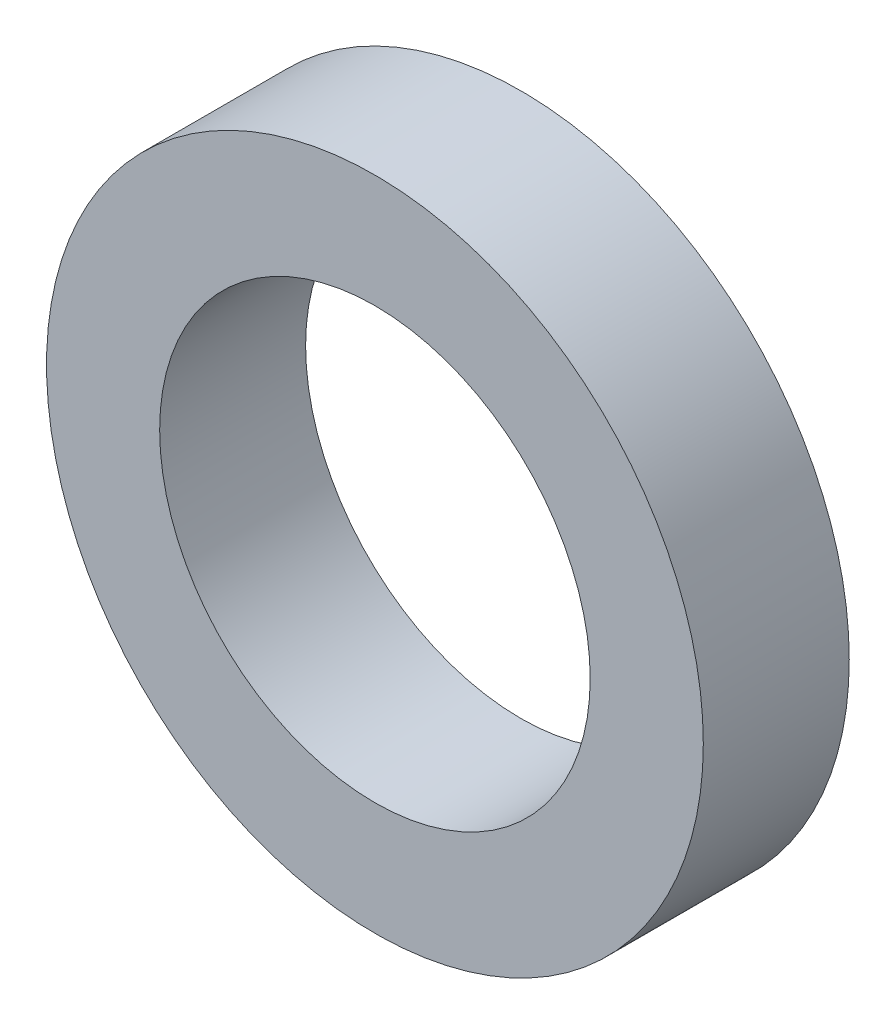
ISO-10303-21;
HEADER;
FILE_DESCRIPTION(('STEP AP214'),'2;1');
FILE_NAME('part.step','',(''),(''),'','','');
FILE_SCHEMA(('AUTOMOTIVE_DESIGN { 1 0 10303 214 1 1 1 1 }'));
ENDSEC;
DATA;
#1=APPLICATION_CONTEXT('core data for automotive mechanical design processes');
#2=APPLICATION_PROTOCOL_DEFINITION('international standard','automotive_design',2000,#1);
#3=PRODUCT_CONTEXT('',#1,'mechanical');
#4=PRODUCT('Part','Part','',(#3));
#5=PRODUCT_RELATED_PRODUCT_CATEGORY('part','',(#4));
#6=PRODUCT_DEFINITION_FORMATION('','',#4);
#7=PRODUCT_DEFINITION_CONTEXT('part definition',#1,'design');
#8=PRODUCT_DEFINITION('design','',#6,#7);
#9=PRODUCT_DEFINITION_SHAPE('','',#8);
#10=(LENGTH_UNIT() NAMED_UNIT(*) SI_UNIT(.MILLI.,.METRE.));
#11=(NAMED_UNIT(*) PLANE_ANGLE_UNIT() SI_UNIT($,.RADIAN.));
#12=(NAMED_UNIT(*) SI_UNIT($,.STERADIAN.) SOLID_ANGLE_UNIT());
#13=UNCERTAINTY_MEASURE_WITH_UNIT(LENGTH_MEASURE(1.E-05),#10,'distance_accuracy_value','');
#14=(GEOMETRIC_REPRESENTATION_CONTEXT(3) GLOBAL_UNCERTAINTY_ASSIGNED_CONTEXT((#13)) GLOBAL_UNIT_ASSIGNED_CONTEXT((#10,
#11,#12)) REPRESENTATION_CONTEXT('',''));
#15=CARTESIAN_POINT('',(0.,0.,0.));
#16=DIRECTION('',(0.,0.,1.));
#17=DIRECTION('',(1.,0.,0.));
#18=AXIS2_PLACEMENT_3D('',#15,#16,#17);
#19=CARTESIAN_POINT('',(-45.,-4.,2.));
#20=DIRECTION('',(0.,0.,1.));
#21=DIRECTION('',(1.,0.,0.));
#22=AXIS2_PLACEMENT_3D('',#19,#20,#21);
#23=PLANE('',#22);
#24=CARTESIAN_POINT('',(-45.,-4.,2.));
#25=DIRECTION('',(0.,0.,1.));
#26=DIRECTION('',(1.,0.,0.));
#27=AXIS2_PLACEMENT_3D('',#24,#25,#26);
#28=CIRCLE('',#27,4.5);
#29=CARTESIAN_POINT('',(-40.5,-4.,2.));
#30=VERTEX_POINT('',#29);
#31=EDGE_CURVE('E10',#30,#30,#28,.T.);
#32=ORIENTED_EDGE('',*,*,#31,.T.);
#33=EDGE_LOOP('',(#32));
#34=FACE_BOUND('',#33,.T.);
#35=CARTESIAN_POINT('',(-45.,-4.,2.));
#36=DIRECTION('',(0.,0.,1.));
#37=DIRECTION('',(1.,0.,0.));
#38=AXIS2_PLACEMENT_3D('',#35,#36,#37);
#39=CIRCLE('',#38,2.95);
#40=CARTESIAN_POINT('',(-42.05,-4.,2.));
#41=VERTEX_POINT('',#40);
#42=EDGE_CURVE('E42',#41,#41,#39,.T.);
#43=ORIENTED_EDGE('',*,*,#42,.F.);
#44=EDGE_LOOP('',(#43));
#45=FACE_BOUND('',#44,.T.);
#46=ADVANCED_FACE('F31',(#34,#45),#23,.T.);
#47=CARTESIAN_POINT('',(-45.,-4.,0.));
#48=DIRECTION('',(0.,0.,1.));
#49=DIRECTION('',(1.,0.,0.));
#50=AXIS2_PLACEMENT_3D('',#47,#48,#49);
#51=PLANE('',#50);
#52=CARTESIAN_POINT('',(-45.,-4.,0.));
#53=DIRECTION('',(0.,0.,1.));
#54=DIRECTION('',(1.,0.,0.));
#55=AXIS2_PLACEMENT_3D('',#52,#53,#54);
#56=CIRCLE('',#55,4.5);
#57=CARTESIAN_POINT('',(-40.5,-4.,0.));
#58=VERTEX_POINT('',#57);
#59=EDGE_CURVE('E35',#58,#58,#56,.T.);
#60=ORIENTED_EDGE('',*,*,#59,.F.);
#61=EDGE_LOOP('',(#60));
#62=FACE_BOUND('',#61,.T.);
#63=CARTESIAN_POINT('',(-45.,-4.,0.));
#64=DIRECTION('',(0.,0.,1.));
#65=DIRECTION('',(1.,0.,0.));
#66=AXIS2_PLACEMENT_3D('',#63,#64,#65);
#67=CIRCLE('',#66,2.95);
#68=CARTESIAN_POINT('',(-42.05,-4.,0.));
#69=VERTEX_POINT('',#68);
#70=EDGE_CURVE('E44',#69,#69,#67,.T.);
#71=ORIENTED_EDGE('',*,*,#70,.T.);
#72=EDGE_LOOP('',(#71));
#73=FACE_BOUND('',#72,.T.);
#74=ADVANCED_FACE('F54',(#62,#73),#51,.F.);
#75=CARTESIAN_POINT('',(-45.,-4.,2.));
#76=DIRECTION('',(0.,0.,-1.));
#77=DIRECTION('',(-1.,0.,0.));
#78=AXIS2_PLACEMENT_3D('',#75,#76,#77);
#79=CYLINDRICAL_SURFACE('',#78,4.5);
#80=ORIENTED_EDGE('',*,*,#31,.F.);
#81=EDGE_LOOP('',(#80));
#82=FACE_BOUND('',#81,.T.);
#83=ORIENTED_EDGE('',*,*,#59,.T.);
#84=EDGE_LOOP('',(#83));
#85=FACE_BOUND('',#84,.T.);
#86=ADVANCED_FACE('F33',(#82,#85),#79,.T.);
#87=CARTESIAN_POINT('',(-45.,-4.,2.));
#88=DIRECTION('',(0.,0.,-1.));
#89=DIRECTION('',(-1.,0.,0.));
#90=AXIS2_PLACEMENT_3D('',#87,#88,#89);
#91=CYLINDRICAL_SURFACE('',#90,2.95);
#92=ORIENTED_EDGE('',*,*,#42,.T.);
#93=EDGE_LOOP('',(#92));
#94=FACE_BOUND('',#93,.T.);
#95=ORIENTED_EDGE('',*,*,#70,.F.);
#96=EDGE_LOOP('',(#95));
#97=FACE_BOUND('',#96,.T.);
#98=ADVANCED_FACE('F50',(#94,#97),#91,.F.);
#99=CLOSED_SHELL('',(#46,#74,#86,#98));
#100=MANIFOLD_SOLID_BREP('B2',#99);
#101=ADVANCED_BREP_SHAPE_REPRESENTATION('',(#18,#100),#14);
#102=SHAPE_DEFINITION_REPRESENTATION(#9,#101);
ENDSEC;
END-ISO-10303-21;
